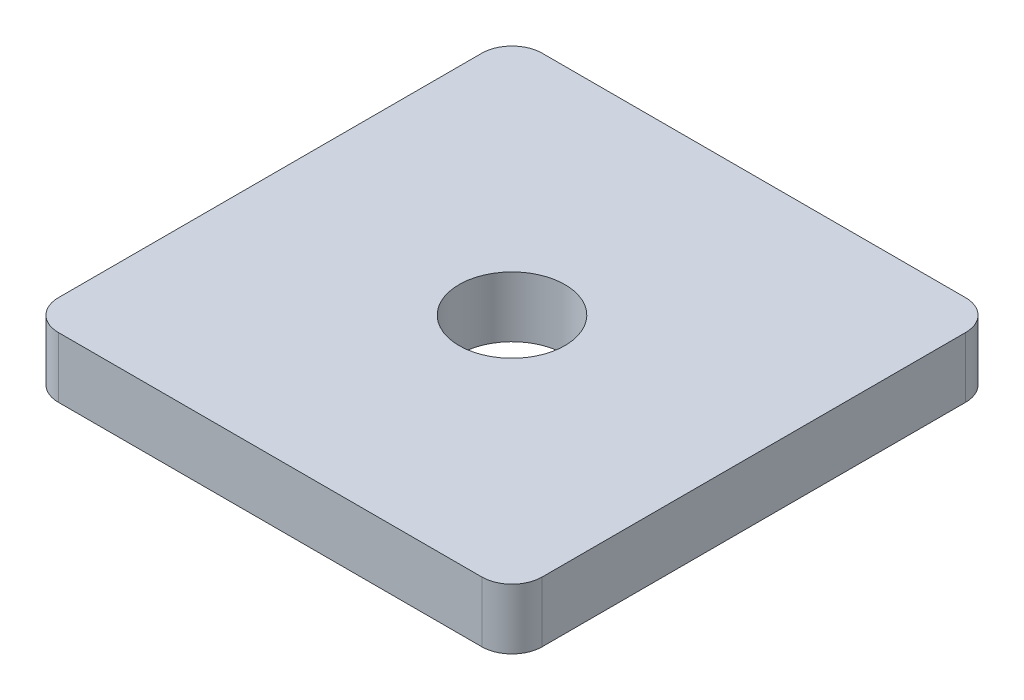
ISO-10303-21;
HEADER;
FILE_DESCRIPTION(('STEP AP214'),'2;1');
FILE_NAME('part.step','',(''),(''),'','','');
FILE_SCHEMA(('AUTOMOTIVE_DESIGN { 1 0 10303 214 1 1 1 1 }'));
ENDSEC;
DATA;
#1=APPLICATION_CONTEXT('core data for automotive mechanical design processes');
#2=APPLICATION_PROTOCOL_DEFINITION('international standard','automotive_design',2000,#1);
#3=PRODUCT_CONTEXT('',#1,'mechanical');
#4=PRODUCT('Part','Part','',(#3));
#5=PRODUCT_RELATED_PRODUCT_CATEGORY('part','',(#4));
#6=PRODUCT_DEFINITION_FORMATION('','',#4);
#7=PRODUCT_DEFINITION_CONTEXT('part definition',#1,'design');
#8=PRODUCT_DEFINITION('design','',#6,#7);
#9=PRODUCT_DEFINITION_SHAPE('','',#8);
#10=(LENGTH_UNIT() NAMED_UNIT(*) SI_UNIT(.MILLI.,.METRE.));
#11=(NAMED_UNIT(*) PLANE_ANGLE_UNIT() SI_UNIT($,.RADIAN.));
#12=(NAMED_UNIT(*) SI_UNIT($,.STERADIAN.) SOLID_ANGLE_UNIT());
#13=UNCERTAINTY_MEASURE_WITH_UNIT(LENGTH_MEASURE(1.E-05),#10,'distance_accuracy_value','');
#14=(GEOMETRIC_REPRESENTATION_CONTEXT(3) GLOBAL_UNCERTAINTY_ASSIGNED_CONTEXT((#13)) GLOBAL_UNIT_ASSIGNED_CONTEXT((#10,
#11,#12)) REPRESENTATION_CONTEXT('',''));
#15=CARTESIAN_POINT('',(0.,0.,0.));
#16=DIRECTION('',(0.,0.,1.));
#17=DIRECTION('',(1.,0.,0.));
#18=AXIS2_PLACEMENT_3D('',#15,#16,#17);
#19=CARTESIAN_POINT('',(8.,2.,8.));
#20=DIRECTION('',(-1.,0.,0.));
#21=DIRECTION('',(0.,0.,1.));
#22=AXIS2_PLACEMENT_3D('',#19,#20,#21);
#23=PLANE('',#22);
#24=DIRECTION('',(0.,0.,-1.));
#25=VECTOR('',#24,1.);
#26=CARTESIAN_POINT('',(8.,0.,8.));
#27=LINE('',#26,#25);
#28=CARTESIAN_POINT('',(8.,0.,7.));
#29=VERTEX_POINT('',#28);
#30=CARTESIAN_POINT('',(8.,0.,-7.));
#31=VERTEX_POINT('',#30);
#32=EDGE_CURVE('E129',#29,#31,#27,.T.);
#33=ORIENTED_EDGE('',*,*,#32,.T.);
#34=DIRECTION('',(0.,-1.,0.));
#35=VECTOR('',#34,1.);
#36=CARTESIAN_POINT('',(8.,2.,-7.));
#37=LINE('',#36,#35);
#38=CARTESIAN_POINT('',(8.,2.,-7.));
#39=VERTEX_POINT('',#38);
#40=EDGE_CURVE('E11',#31,#39,#37,.F.);
#41=ORIENTED_EDGE('',*,*,#40,.T.);
#42=DIRECTION('',(0.,0.,-1.));
#43=VECTOR('',#42,1.);
#44=CARTESIAN_POINT('',(8.,2.,8.));
#45=LINE('',#44,#43);
#46=CARTESIAN_POINT('',(8.,2.,7.));
#47=VERTEX_POINT('',#46);
#48=EDGE_CURVE('E127',#47,#39,#45,.T.);
#49=ORIENTED_EDGE('',*,*,#48,.F.);
#50=DIRECTION('',(0.,-1.,0.));
#51=VECTOR('',#50,1.);
#52=CARTESIAN_POINT('',(8.,2.,7.));
#53=LINE('',#52,#51);
#54=EDGE_CURVE('E41',#47,#29,#53,.T.);
#55=ORIENTED_EDGE('',*,*,#54,.T.);
#56=EDGE_LOOP('',(#33,#41,#49,#55));
#57=FACE_BOUND('',#56,.T.);
#58=ADVANCED_FACE('F33',(#57),#23,.F.);
#59=CARTESIAN_POINT('',(-8.,2.,-8.));
#60=DIRECTION('',(0.,0.,1.));
#61=DIRECTION('',(1.,0.,0.));
#62=AXIS2_PLACEMENT_3D('',#59,#60,#61);
#63=PLANE('',#62);
#64=DIRECTION('',(-1.,0.,0.));
#65=VECTOR('',#64,1.);
#66=CARTESIAN_POINT('',(-8.,0.,-8.));
#67=LINE('',#66,#65);
#68=CARTESIAN_POINT('',(7.,0.,-8.));
#69=VERTEX_POINT('',#68);
#70=CARTESIAN_POINT('',(-7.,0.,-8.));
#71=VERTEX_POINT('',#70);
#72=EDGE_CURVE('E125',#69,#71,#67,.T.);
#73=ORIENTED_EDGE('',*,*,#72,.T.);
#74=DIRECTION('',(0.,-1.,0.));
#75=VECTOR('',#74,1.);
#76=CARTESIAN_POINT('',(-7.,2.,-8.));
#77=LINE('',#76,#75);
#78=CARTESIAN_POINT('',(-7.,2.,-8.));
#79=VERTEX_POINT('',#78);
#80=EDGE_CURVE('E104',#71,#79,#77,.F.);
#81=ORIENTED_EDGE('',*,*,#80,.T.);
#82=DIRECTION('',(-1.,0.,0.));
#83=VECTOR('',#82,1.);
#84=CARTESIAN_POINT('',(-8.,2.,-8.));
#85=LINE('',#84,#83);
#86=CARTESIAN_POINT('',(7.,2.,-8.));
#87=VERTEX_POINT('',#86);
#88=EDGE_CURVE('E169',#87,#79,#85,.T.);
#89=ORIENTED_EDGE('',*,*,#88,.F.);
#90=DIRECTION('',(0.,-1.,0.));
#91=VECTOR('',#90,1.);
#92=CARTESIAN_POINT('',(7.,2.,-8.));
#93=LINE('',#92,#91);
#94=EDGE_CURVE('E109',#87,#69,#93,.T.);
#95=ORIENTED_EDGE('',*,*,#94,.T.);
#96=EDGE_LOOP('',(#73,#81,#89,#95));
#97=FACE_BOUND('',#96,.T.);
#98=ADVANCED_FACE('F186',(#97),#63,.F.);
#99=CARTESIAN_POINT('',(-8.,2.,8.));
#100=DIRECTION('',(1.,0.,0.));
#101=DIRECTION('',(0.,0.,-1.));
#102=AXIS2_PLACEMENT_3D('',#99,#100,#101);
#103=PLANE('',#102);
#104=DIRECTION('',(0.,0.,1.));
#105=VECTOR('',#104,1.);
#106=CARTESIAN_POINT('',(-8.,2.,8.));
#107=LINE('',#106,#105);
#108=CARTESIAN_POINT('',(-8.,2.,-7.));
#109=VERTEX_POINT('',#108);
#110=CARTESIAN_POINT('',(-8.,2.,7.));
#111=VERTEX_POINT('',#110);
#112=EDGE_CURVE('E118',#109,#111,#107,.T.);
#113=ORIENTED_EDGE('',*,*,#112,.F.);
#114=DIRECTION('',(0.,-1.,0.));
#115=VECTOR('',#114,1.);
#116=CARTESIAN_POINT('',(-8.,2.,-7.));
#117=LINE('',#116,#115);
#118=CARTESIAN_POINT('',(-8.,0.,-7.));
#119=VERTEX_POINT('',#118);
#120=EDGE_CURVE('E103',#109,#119,#117,.T.);
#121=ORIENTED_EDGE('',*,*,#120,.T.);
#122=DIRECTION('',(0.,0.,1.));
#123=VECTOR('',#122,1.);
#124=CARTESIAN_POINT('',(-8.,0.,8.));
#125=LINE('',#124,#123);
#126=CARTESIAN_POINT('',(-8.,0.,7.));
#127=VERTEX_POINT('',#126);
#128=EDGE_CURVE('E116',#119,#127,#125,.T.);
#129=ORIENTED_EDGE('',*,*,#128,.T.);
#130=DIRECTION('',(0.,-1.,0.));
#131=VECTOR('',#130,1.);
#132=CARTESIAN_POINT('',(-8.,2.,7.));
#133=LINE('',#132,#131);
#134=EDGE_CURVE('E120',#127,#111,#133,.F.);
#135=ORIENTED_EDGE('',*,*,#134,.T.);
#136=EDGE_LOOP('',(#113,#121,#129,#135));
#137=FACE_BOUND('',#136,.T.);
#138=ADVANCED_FACE('F115',(#137),#103,.F.);
#139=CARTESIAN_POINT('',(-8.,2.,8.));
#140=DIRECTION('',(0.,0.,-1.));
#141=DIRECTION('',(-1.,0.,0.));
#142=AXIS2_PLACEMENT_3D('',#139,#140,#141);
#143=PLANE('',#142);
#144=DIRECTION('',(1.,0.,0.));
#145=VECTOR('',#144,1.);
#146=CARTESIAN_POINT('',(-8.,2.,8.));
#147=LINE('',#146,#145);
#148=CARTESIAN_POINT('',(-7.,2.,8.));
#149=VERTEX_POINT('',#148);
#150=CARTESIAN_POINT('',(7.,2.,8.));
#151=VERTEX_POINT('',#150);
#152=EDGE_CURVE('E133',#149,#151,#147,.T.);
#153=ORIENTED_EDGE('',*,*,#152,.F.);
#154=DIRECTION('',(0.,-1.,0.));
#155=VECTOR('',#154,1.);
#156=CARTESIAN_POINT('',(-7.,2.,8.));
#157=LINE('',#156,#155);
#158=CARTESIAN_POINT('',(-7.,0.,8.));
#159=VERTEX_POINT('',#158);
#160=EDGE_CURVE('E150',#149,#159,#157,.T.);
#161=ORIENTED_EDGE('',*,*,#160,.T.);
#162=DIRECTION('',(1.,0.,0.));
#163=VECTOR('',#162,1.);
#164=CARTESIAN_POINT('',(-8.,0.,8.));
#165=LINE('',#164,#163);
#166=CARTESIAN_POINT('',(7.,0.,8.));
#167=VERTEX_POINT('',#166);
#168=EDGE_CURVE('E124',#159,#167,#165,.T.);
#169=ORIENTED_EDGE('',*,*,#168,.T.);
#170=DIRECTION('',(0.,-1.,0.));
#171=VECTOR('',#170,1.);
#172=CARTESIAN_POINT('',(7.,2.,8.));
#173=LINE('',#172,#171);
#174=EDGE_CURVE('E48',#167,#151,#173,.F.);
#175=ORIENTED_EDGE('',*,*,#174,.T.);
#176=EDGE_LOOP('',(#153,#161,#169,#175));
#177=FACE_BOUND('',#176,.T.);
#178=ADVANCED_FACE('F180',(#177),#143,.F.);
#179=CARTESIAN_POINT('',(0.,2.,0.));
#180=DIRECTION('',(0.,-1.,0.));
#181=DIRECTION('',(0.,0.,-1.));
#182=AXIS2_PLACEMENT_3D('',#179,#180,#181);
#183=PLANE('',#182);
#184=CARTESIAN_POINT('',(0.,2.,0.));
#185=DIRECTION('',(0.,1.,0.));
#186=DIRECTION('',(0.,0.,1.));
#187=AXIS2_PLACEMENT_3D('',#184,#185,#186);
#188=CIRCLE('',#187,1.75);
#189=CARTESIAN_POINT('',(0.,2.,1.75));
#190=VERTEX_POINT('',#189);
#191=EDGE_CURVE('E164',#190,#190,#188,.T.);
#192=ORIENTED_EDGE('',*,*,#191,.F.);
#193=EDGE_LOOP('',(#192));
#194=FACE_BOUND('',#193,.T.);
#195=ORIENTED_EDGE('',*,*,#88,.T.);
#196=CARTESIAN_POINT('',(-7.,2.,-7.));
#197=DIRECTION('',(0.,-1.,0.));
#198=DIRECTION('',(0.,0.,-1.));
#199=AXIS2_PLACEMENT_3D('',#196,#197,#198);
#200=CIRCLE('',#199,1.);
#201=EDGE_CURVE('E147',#79,#109,#200,.F.);
#202=ORIENTED_EDGE('',*,*,#201,.T.);
#203=ORIENTED_EDGE('',*,*,#112,.T.);
#204=CARTESIAN_POINT('',(-7.,2.,7.));
#205=DIRECTION('',(0.,-1.,0.));
#206=DIRECTION('',(0.,0.,-1.));
#207=AXIS2_PLACEMENT_3D('',#204,#205,#206);
#208=CIRCLE('',#207,1.);
#209=EDGE_CURVE('E55',#111,#149,#208,.F.);
#210=ORIENTED_EDGE('',*,*,#209,.T.);
#211=ORIENTED_EDGE('',*,*,#152,.T.);
#212=CARTESIAN_POINT('',(7.,2.,7.));
#213=DIRECTION('',(0.,-1.,0.));
#214=DIRECTION('',(0.,0.,-1.));
#215=AXIS2_PLACEMENT_3D('',#212,#213,#214);
#216=CIRCLE('',#215,1.);
#217=EDGE_CURVE('E142',#151,#47,#216,.F.);
#218=ORIENTED_EDGE('',*,*,#217,.T.);
#219=ORIENTED_EDGE('',*,*,#48,.T.);
#220=CARTESIAN_POINT('',(7.,2.,-7.));
#221=DIRECTION('',(0.,-1.,0.));
#222=DIRECTION('',(0.,0.,-1.));
#223=AXIS2_PLACEMENT_3D('',#220,#221,#222);
#224=CIRCLE('',#223,1.);
#225=EDGE_CURVE('E144',#39,#87,#224,.F.);
#226=ORIENTED_EDGE('',*,*,#225,.T.);
#227=EDGE_LOOP('',(#195,#202,#203,#210,#211,#218,#219,#226));
#228=FACE_BOUND('',#227,.T.);
#229=ADVANCED_FACE('F178',(#194,#228),#183,.F.);
#230=CARTESIAN_POINT('',(0.,0.,0.));
#231=DIRECTION('',(0.,-1.,0.));
#232=DIRECTION('',(0.,0.,-1.));
#233=AXIS2_PLACEMENT_3D('',#230,#231,#232);
#234=PLANE('',#233);
#235=CARTESIAN_POINT('',(0.,0.,0.));
#236=DIRECTION('',(0.,1.,0.));
#237=DIRECTION('',(0.,0.,1.));
#238=AXIS2_PLACEMENT_3D('',#235,#236,#237);
#239=CIRCLE('',#238,1.75);
#240=CARTESIAN_POINT('',(0.,0.,1.75));
#241=VERTEX_POINT('',#240);
#242=EDGE_CURVE('E162',#241,#241,#239,.T.);
#243=ORIENTED_EDGE('',*,*,#242,.T.);
#244=EDGE_LOOP('',(#243));
#245=FACE_BOUND('',#244,.T.);
#246=ORIENTED_EDGE('',*,*,#128,.F.);
#247=CARTESIAN_POINT('',(-7.,0.,-7.));
#248=DIRECTION('',(0.,-1.,0.));
#249=DIRECTION('',(0.,0.,-1.));
#250=AXIS2_PLACEMENT_3D('',#247,#248,#249);
#251=CIRCLE('',#250,1.);
#252=EDGE_CURVE('E99',#119,#71,#251,.T.);
#253=ORIENTED_EDGE('',*,*,#252,.T.);
#254=ORIENTED_EDGE('',*,*,#72,.F.);
#255=CARTESIAN_POINT('',(7.,0.,-7.));
#256=DIRECTION('',(0.,-1.,0.));
#257=DIRECTION('',(0.,0.,-1.));
#258=AXIS2_PLACEMENT_3D('',#255,#256,#257);
#259=CIRCLE('',#258,1.);
#260=EDGE_CURVE('E136',#69,#31,#259,.T.);
#261=ORIENTED_EDGE('',*,*,#260,.T.);
#262=ORIENTED_EDGE('',*,*,#32,.F.);
#263=CARTESIAN_POINT('',(7.,0.,7.));
#264=DIRECTION('',(0.,-1.,0.));
#265=DIRECTION('',(0.,0.,-1.));
#266=AXIS2_PLACEMENT_3D('',#263,#264,#265);
#267=CIRCLE('',#266,1.);
#268=EDGE_CURVE('E119',#29,#167,#267,.T.);
#269=ORIENTED_EDGE('',*,*,#268,.T.);
#270=ORIENTED_EDGE('',*,*,#168,.F.);
#271=CARTESIAN_POINT('',(-7.,0.,7.));
#272=DIRECTION('',(0.,-1.,0.));
#273=DIRECTION('',(0.,0.,-1.));
#274=AXIS2_PLACEMENT_3D('',#271,#272,#273);
#275=CIRCLE('',#274,1.);
#276=EDGE_CURVE('E110',#159,#127,#275,.T.);
#277=ORIENTED_EDGE('',*,*,#276,.T.);
#278=EDGE_LOOP('',(#246,#253,#254,#261,#262,#269,#270,#277));
#279=FACE_BOUND('',#278,.T.);
#280=ADVANCED_FACE('F122',(#245,#279),#234,.T.);
#281=CARTESIAN_POINT('',(-7.,2.,-7.));
#282=DIRECTION('',(0.,-1.,0.));
#283=DIRECTION('',(0.,0.,-1.));
#284=AXIS2_PLACEMENT_3D('',#281,#282,#283);
#285=CYLINDRICAL_SURFACE('',#284,1.);
#286=ORIENTED_EDGE('',*,*,#201,.F.);
#287=ORIENTED_EDGE('',*,*,#80,.F.);
#288=ORIENTED_EDGE('',*,*,#252,.F.);
#289=ORIENTED_EDGE('',*,*,#120,.F.);
#290=EDGE_LOOP('',(#286,#287,#288,#289));
#291=FACE_BOUND('',#290,.T.);
#292=ADVANCED_FACE('F102',(#291),#285,.T.);
#293=CARTESIAN_POINT('',(-7.,2.,7.));
#294=DIRECTION('',(0.,-1.,0.));
#295=DIRECTION('',(0.,0.,-1.));
#296=AXIS2_PLACEMENT_3D('',#293,#294,#295);
#297=CYLINDRICAL_SURFACE('',#296,1.);
#298=ORIENTED_EDGE('',*,*,#209,.F.);
#299=ORIENTED_EDGE('',*,*,#134,.F.);
#300=ORIENTED_EDGE('',*,*,#276,.F.);
#301=ORIENTED_EDGE('',*,*,#160,.F.);
#302=EDGE_LOOP('',(#298,#299,#300,#301));
#303=FACE_BOUND('',#302,.T.);
#304=ADVANCED_FACE('F196',(#303),#297,.T.);
#305=CARTESIAN_POINT('',(7.,2.,-7.));
#306=DIRECTION('',(0.,-1.,0.));
#307=DIRECTION('',(0.,0.,-1.));
#308=AXIS2_PLACEMENT_3D('',#305,#306,#307);
#309=CYLINDRICAL_SURFACE('',#308,1.);
#310=ORIENTED_EDGE('',*,*,#225,.F.);
#311=ORIENTED_EDGE('',*,*,#40,.F.);
#312=ORIENTED_EDGE('',*,*,#260,.F.);
#313=ORIENTED_EDGE('',*,*,#94,.F.);
#314=EDGE_LOOP('',(#310,#311,#312,#313));
#315=FACE_BOUND('',#314,.T.);
#316=ADVANCED_FACE('F188',(#315),#309,.T.);
#317=CARTESIAN_POINT('',(7.,2.,7.));
#318=DIRECTION('',(0.,-1.,0.));
#319=DIRECTION('',(0.,0.,-1.));
#320=AXIS2_PLACEMENT_3D('',#317,#318,#319);
#321=CYLINDRICAL_SURFACE('',#320,1.);
#322=ORIENTED_EDGE('',*,*,#217,.F.);
#323=ORIENTED_EDGE('',*,*,#174,.F.);
#324=ORIENTED_EDGE('',*,*,#268,.F.);
#325=ORIENTED_EDGE('',*,*,#54,.F.);
#326=EDGE_LOOP('',(#322,#323,#324,#325));
#327=FACE_BOUND('',#326,.T.);
#328=ADVANCED_FACE('F35',(#327),#321,.T.);
#329=CARTESIAN_POINT('',(0.,0.,0.));
#330=DIRECTION('',(0.,1.,0.));
#331=DIRECTION('',(0.,0.,1.));
#332=AXIS2_PLACEMENT_3D('',#329,#330,#331);
#333=CYLINDRICAL_SURFACE('',#332,1.75);
#334=ORIENTED_EDGE('',*,*,#242,.F.);
#335=EDGE_LOOP('',(#334));
#336=FACE_BOUND('',#335,.T.);
#337=ORIENTED_EDGE('',*,*,#191,.T.);
#338=EDGE_LOOP('',(#337));
#339=FACE_BOUND('',#338,.T.);
#340=ADVANCED_FACE('F176',(#336,#339),#333,.F.);
#341=CLOSED_SHELL('',(#58,#98,#138,#178,#229,#280,#292,#304,#316,#328,#340));
#342=MANIFOLD_SOLID_BREP('B2',#341);
#343=ADVANCED_BREP_SHAPE_REPRESENTATION('',(#18,#342),#14);
#344=SHAPE_DEFINITION_REPRESENTATION(#9,#343);
ENDSEC;
END-ISO-10303-21;
